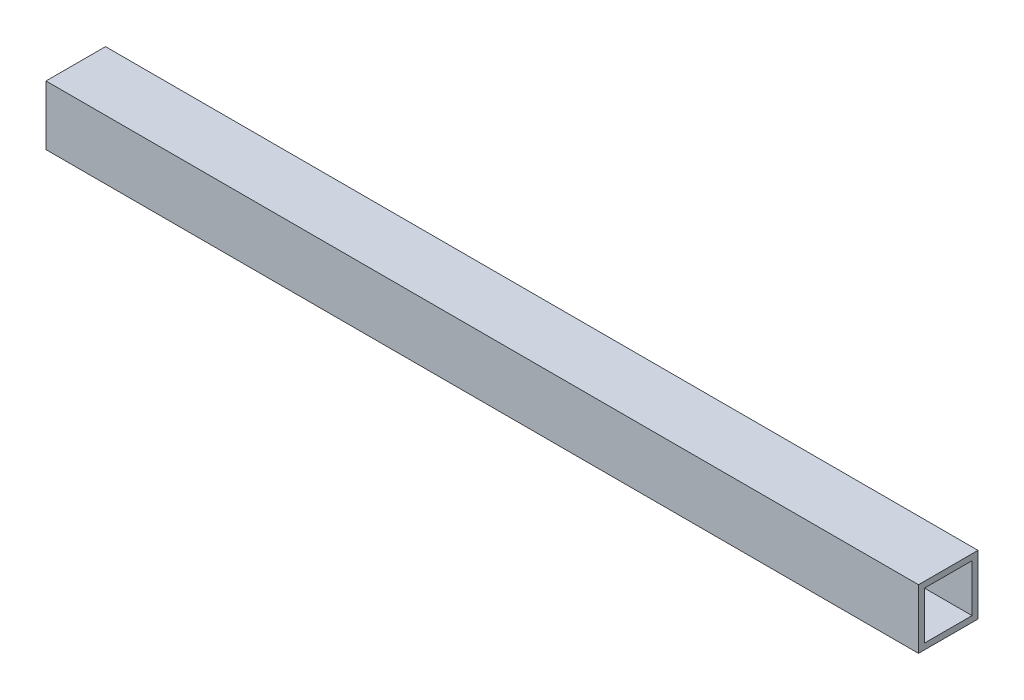
ISO-10303-21;
HEADER;
FILE_DESCRIPTION(('STEP AP214'),'2;1');
FILE_NAME('part.step','',(''),(''),'','','');
FILE_SCHEMA(('AUTOMOTIVE_DESIGN { 1 0 10303 214 1 1 1 1 }'));
ENDSEC;
DATA;
#1=APPLICATION_CONTEXT('core data for automotive mechanical design processes');
#2=APPLICATION_PROTOCOL_DEFINITION('international standard','automotive_design',2000,#1);
#3=PRODUCT_CONTEXT('',#1,'mechanical');
#4=PRODUCT('Part','Part','',(#3));
#5=PRODUCT_RELATED_PRODUCT_CATEGORY('part','',(#4));
#6=PRODUCT_DEFINITION_FORMATION('','',#4);
#7=PRODUCT_DEFINITION_CONTEXT('part definition',#1,'design');
#8=PRODUCT_DEFINITION('design','',#6,#7);
#9=PRODUCT_DEFINITION_SHAPE('','',#8);
#10=(LENGTH_UNIT() NAMED_UNIT(*) SI_UNIT(.MILLI.,.METRE.));
#11=(NAMED_UNIT(*) PLANE_ANGLE_UNIT() SI_UNIT($,.RADIAN.));
#12=(NAMED_UNIT(*) SI_UNIT($,.STERADIAN.) SOLID_ANGLE_UNIT());
#13=UNCERTAINTY_MEASURE_WITH_UNIT(LENGTH_MEASURE(1.E-05),#10,'distance_accuracy_value','');
#14=(GEOMETRIC_REPRESENTATION_CONTEXT(3) GLOBAL_UNCERTAINTY_ASSIGNED_CONTEXT((#13)) GLOBAL_UNIT_ASSIGNED_CONTEXT((#10,
#11,#12)) REPRESENTATION_CONTEXT('',''));
#15=CARTESIAN_POINT('',(0.,0.,0.));
#16=DIRECTION('',(0.,0.,1.));
#17=DIRECTION('',(1.,0.,0.));
#18=AXIS2_PLACEMENT_3D('',#15,#16,#17);
#19=CARTESIAN_POINT('',(110.,0.,0.));
#20=DIRECTION('',(1.,0.,0.));
#21=DIRECTION('',(0.,0.,-1.));
#22=AXIS2_PLACEMENT_3D('',#19,#20,#21);
#23=PLANE('',#22);
#24=DIRECTION('',(0.,1.,0.));
#25=VECTOR('',#24,1.);
#26=CARTESIAN_POINT('',(110.,7.5,-7.5));
#27=LINE('',#26,#25);
#28=CARTESIAN_POINT('',(110.,-7.5,-7.5));
#29=VERTEX_POINT('',#28);
#30=CARTESIAN_POINT('',(110.,7.5,-7.5));
#31=VERTEX_POINT('',#30);
#32=EDGE_CURVE('E134',#29,#31,#27,.T.);
#33=ORIENTED_EDGE('',*,*,#32,.T.);
#34=DIRECTION('',(0.,0.,1.));
#35=VECTOR('',#34,1.);
#36=CARTESIAN_POINT('',(110.,7.5,7.5));
#37=LINE('',#36,#35);
#38=CARTESIAN_POINT('',(110.,7.5,7.5));
#39=VERTEX_POINT('',#38);
#40=EDGE_CURVE('E137',#31,#39,#37,.T.);
#41=ORIENTED_EDGE('',*,*,#40,.T.);
#42=DIRECTION('',(0.,-1.,0.));
#43=VECTOR('',#42,1.);
#44=CARTESIAN_POINT('',(110.,7.5,7.5));
#45=LINE('',#44,#43);
#46=CARTESIAN_POINT('',(110.,-7.5,7.5));
#47=VERTEX_POINT('',#46);
#48=EDGE_CURVE('E140',#39,#47,#45,.T.);
#49=ORIENTED_EDGE('',*,*,#48,.T.);
#50=DIRECTION('',(0.,0.,-1.));
#51=VECTOR('',#50,1.);
#52=CARTESIAN_POINT('',(110.,-7.5,7.5));
#53=LINE('',#52,#51);
#54=EDGE_CURVE('E142',#47,#29,#53,.T.);
#55=ORIENTED_EDGE('',*,*,#54,.T.);
#56=EDGE_LOOP('',(#33,#41,#49,#55));
#57=FACE_BOUND('',#56,.T.);
#58=DIRECTION('',(0.,0.,-1.));
#59=VECTOR('',#58,1.);
#60=CARTESIAN_POINT('',(110.,-6.,6.));
#61=LINE('',#60,#59);
#62=CARTESIAN_POINT('',(110.,-6.,6.));
#63=VERTEX_POINT('',#62);
#64=CARTESIAN_POINT('',(110.,-6.,-6.));
#65=VERTEX_POINT('',#64);
#66=EDGE_CURVE('E106',#63,#65,#61,.T.);
#67=ORIENTED_EDGE('',*,*,#66,.F.);
#68=DIRECTION('',(0.,-1.,0.));
#69=VECTOR('',#68,1.);
#70=CARTESIAN_POINT('',(110.,6.,6.));
#71=LINE('',#70,#69);
#72=CARTESIAN_POINT('',(110.,6.,6.));
#73=VERTEX_POINT('',#72);
#74=EDGE_CURVE('E98',#73,#63,#71,.T.);
#75=ORIENTED_EDGE('',*,*,#74,.F.);
#76=DIRECTION('',(0.,0.,1.));
#77=VECTOR('',#76,1.);
#78=CARTESIAN_POINT('',(110.,6.,6.));
#79=LINE('',#78,#77);
#80=CARTESIAN_POINT('',(110.,6.,-6.));
#81=VERTEX_POINT('',#80);
#82=EDGE_CURVE('E120',#81,#73,#79,.T.);
#83=ORIENTED_EDGE('',*,*,#82,.F.);
#84=DIRECTION('',(0.,1.,0.));
#85=VECTOR('',#84,1.);
#86=CARTESIAN_POINT('',(110.,6.,-6.));
#87=LINE('',#86,#85);
#88=EDGE_CURVE('E118',#65,#81,#87,.T.);
#89=ORIENTED_EDGE('',*,*,#88,.F.);
#90=EDGE_LOOP('',(#67,#75,#83,#89));
#91=FACE_BOUND('',#90,.T.);
#92=ADVANCED_FACE('F33',(#57,#91),#23,.T.);
#93=CARTESIAN_POINT('',(-110.,0.,0.));
#94=DIRECTION('',(1.,0.,0.));
#95=DIRECTION('',(0.,0.,-1.));
#96=AXIS2_PLACEMENT_3D('',#93,#94,#95);
#97=PLANE('',#96);
#98=DIRECTION('',(0.,1.,0.));
#99=VECTOR('',#98,1.);
#100=CARTESIAN_POINT('',(-110.,7.5,-7.5));
#101=LINE('',#100,#99);
#102=CARTESIAN_POINT('',(-110.,-7.5,-7.5));
#103=VERTEX_POINT('',#102);
#104=CARTESIAN_POINT('',(-110.,7.5,-7.5));
#105=VERTEX_POINT('',#104);
#106=EDGE_CURVE('E114',#103,#105,#101,.T.);
#107=ORIENTED_EDGE('',*,*,#106,.F.);
#108=DIRECTION('',(0.,0.,-1.));
#109=VECTOR('',#108,1.);
#110=CARTESIAN_POINT('',(-110.,-7.5,7.5));
#111=LINE('',#110,#109);
#112=CARTESIAN_POINT('',(-110.,-7.5,7.5));
#113=VERTEX_POINT('',#112);
#114=EDGE_CURVE('E138',#113,#103,#111,.T.);
#115=ORIENTED_EDGE('',*,*,#114,.F.);
#116=DIRECTION('',(0.,-1.,0.));
#117=VECTOR('',#116,1.);
#118=CARTESIAN_POINT('',(-110.,7.5,7.5));
#119=LINE('',#118,#117);
#120=CARTESIAN_POINT('',(-110.,7.5,7.5));
#121=VERTEX_POINT('',#120);
#122=EDGE_CURVE('E149',#121,#113,#119,.T.);
#123=ORIENTED_EDGE('',*,*,#122,.F.);
#124=DIRECTION('',(0.,0.,1.));
#125=VECTOR('',#124,1.);
#126=CARTESIAN_POINT('',(-110.,7.5,7.5));
#127=LINE('',#126,#125);
#128=EDGE_CURVE('E147',#105,#121,#127,.T.);
#129=ORIENTED_EDGE('',*,*,#128,.F.);
#130=EDGE_LOOP('',(#107,#115,#123,#129));
#131=FACE_BOUND('',#130,.T.);
#132=DIRECTION('',(0.,-1.,0.));
#133=VECTOR('',#132,1.);
#134=CARTESIAN_POINT('',(-110.,6.,6.));
#135=LINE('',#134,#133);
#136=CARTESIAN_POINT('',(-110.,6.,6.));
#137=VERTEX_POINT('',#136);
#138=CARTESIAN_POINT('',(-110.,-6.,6.));
#139=VERTEX_POINT('',#138);
#140=EDGE_CURVE('E56',#137,#139,#135,.T.);
#141=ORIENTED_EDGE('',*,*,#140,.T.);
#142=DIRECTION('',(0.,0.,-1.));
#143=VECTOR('',#142,1.);
#144=CARTESIAN_POINT('',(-110.,-6.,6.));
#145=LINE('',#144,#143);
#146=CARTESIAN_POINT('',(-110.,-6.,-6.));
#147=VERTEX_POINT('',#146);
#148=EDGE_CURVE('E113',#139,#147,#145,.T.);
#149=ORIENTED_EDGE('',*,*,#148,.T.);
#150=DIRECTION('',(0.,1.,0.));
#151=VECTOR('',#150,1.);
#152=CARTESIAN_POINT('',(-110.,6.,-6.));
#153=LINE('',#152,#151);
#154=CARTESIAN_POINT('',(-110.,6.,-6.));
#155=VERTEX_POINT('',#154);
#156=EDGE_CURVE('E126',#147,#155,#153,.T.);
#157=ORIENTED_EDGE('',*,*,#156,.T.);
#158=DIRECTION('',(0.,0.,1.));
#159=VECTOR('',#158,1.);
#160=CARTESIAN_POINT('',(-110.,6.,6.));
#161=LINE('',#160,#159);
#162=EDGE_CURVE('E107',#155,#137,#161,.T.);
#163=ORIENTED_EDGE('',*,*,#162,.T.);
#164=EDGE_LOOP('',(#141,#149,#157,#163));
#165=FACE_BOUND('',#164,.T.);
#166=ADVANCED_FACE('F167',(#131,#165),#97,.F.);
#167=CARTESIAN_POINT('',(110.,7.5,-7.5));
#168=DIRECTION('',(0.,0.,1.));
#169=DIRECTION('',(0.,-1.,0.));
#170=AXIS2_PLACEMENT_3D('',#167,#168,#169);
#171=PLANE('',#170);
#172=ORIENTED_EDGE('',*,*,#106,.T.);
#173=DIRECTION('',(-1.,0.,0.));
#174=VECTOR('',#173,1.);
#175=CARTESIAN_POINT('',(110.,7.5,-7.5));
#176=LINE('',#175,#174);
#177=EDGE_CURVE('E11',#31,#105,#176,.T.);
#178=ORIENTED_EDGE('',*,*,#177,.F.);
#179=ORIENTED_EDGE('',*,*,#32,.F.);
#180=DIRECTION('',(-1.,0.,0.));
#181=VECTOR('',#180,1.);
#182=CARTESIAN_POINT('',(110.,-7.5,-7.5));
#183=LINE('',#182,#181);
#184=EDGE_CURVE('E144',#29,#103,#183,.T.);
#185=ORIENTED_EDGE('',*,*,#184,.T.);
#186=EDGE_LOOP('',(#172,#178,#179,#185));
#187=FACE_BOUND('',#186,.T.);
#188=ADVANCED_FACE('F35',(#187),#171,.F.);
#189=CARTESIAN_POINT('',(110.,7.5,7.5));
#190=DIRECTION('',(0.,-1.,0.));
#191=DIRECTION('',(0.,0.,-1.));
#192=AXIS2_PLACEMENT_3D('',#189,#190,#191);
#193=PLANE('',#192);
#194=ORIENTED_EDGE('',*,*,#128,.T.);
#195=DIRECTION('',(-1.,0.,0.));
#196=VECTOR('',#195,1.);
#197=CARTESIAN_POINT('',(110.,7.5,7.5));
#198=LINE('',#197,#196);
#199=EDGE_CURVE('E41',#39,#121,#198,.T.);
#200=ORIENTED_EDGE('',*,*,#199,.F.);
#201=ORIENTED_EDGE('',*,*,#40,.F.);
#202=ORIENTED_EDGE('',*,*,#177,.T.);
#203=EDGE_LOOP('',(#194,#200,#201,#202));
#204=FACE_BOUND('',#203,.T.);
#205=ADVANCED_FACE('F177',(#204),#193,.F.);
#206=CARTESIAN_POINT('',(110.,7.5,7.5));
#207=DIRECTION('',(0.,0.,-1.));
#208=DIRECTION('',(0.,1.,0.));
#209=AXIS2_PLACEMENT_3D('',#206,#207,#208);
#210=PLANE('',#209);
#211=ORIENTED_EDGE('',*,*,#122,.T.);
#212=DIRECTION('',(-1.,0.,0.));
#213=VECTOR('',#212,1.);
#214=CARTESIAN_POINT('',(110.,-7.5,7.5));
#215=LINE('',#214,#213);
#216=EDGE_CURVE('E154',#47,#113,#215,.T.);
#217=ORIENTED_EDGE('',*,*,#216,.F.);
#218=ORIENTED_EDGE('',*,*,#48,.F.);
#219=ORIENTED_EDGE('',*,*,#199,.T.);
#220=EDGE_LOOP('',(#211,#217,#218,#219));
#221=FACE_BOUND('',#220,.T.);
#222=ADVANCED_FACE('F161',(#221),#210,.F.);
#223=CARTESIAN_POINT('',(110.,-7.5,7.5));
#224=DIRECTION('',(0.,1.,0.));
#225=DIRECTION('',(0.,0.,1.));
#226=AXIS2_PLACEMENT_3D('',#223,#224,#225);
#227=PLANE('',#226);
#228=ORIENTED_EDGE('',*,*,#114,.T.);
#229=ORIENTED_EDGE('',*,*,#184,.F.);
#230=ORIENTED_EDGE('',*,*,#54,.F.);
#231=ORIENTED_EDGE('',*,*,#216,.T.);
#232=EDGE_LOOP('',(#228,#229,#230,#231));
#233=FACE_BOUND('',#232,.T.);
#234=ADVANCED_FACE('F171',(#233),#227,.F.);
#235=CARTESIAN_POINT('',(110.,6.,6.));
#236=DIRECTION('',(0.,0.,-1.));
#237=DIRECTION('',(0.,1.,0.));
#238=AXIS2_PLACEMENT_3D('',#235,#236,#237);
#239=PLANE('',#238);
#240=ORIENTED_EDGE('',*,*,#140,.F.);
#241=DIRECTION('',(-1.,0.,0.));
#242=VECTOR('',#241,1.);
#243=CARTESIAN_POINT('',(110.,6.,6.));
#244=LINE('',#243,#242);
#245=EDGE_CURVE('E102',#73,#137,#244,.T.);
#246=ORIENTED_EDGE('',*,*,#245,.F.);
#247=ORIENTED_EDGE('',*,*,#74,.T.);
#248=DIRECTION('',(-1.,0.,0.));
#249=VECTOR('',#248,1.);
#250=CARTESIAN_POINT('',(110.,-6.,6.));
#251=LINE('',#250,#249);
#252=EDGE_CURVE('E101',#63,#139,#251,.T.);
#253=ORIENTED_EDGE('',*,*,#252,.T.);
#254=EDGE_LOOP('',(#240,#246,#247,#253));
#255=FACE_BOUND('',#254,.T.);
#256=ADVANCED_FACE('F100',(#255),#239,.T.);
#257=CARTESIAN_POINT('',(110.,-6.,6.));
#258=DIRECTION('',(0.,1.,0.));
#259=DIRECTION('',(0.,0.,1.));
#260=AXIS2_PLACEMENT_3D('',#257,#258,#259);
#261=PLANE('',#260);
#262=ORIENTED_EDGE('',*,*,#148,.F.);
#263=ORIENTED_EDGE('',*,*,#252,.F.);
#264=ORIENTED_EDGE('',*,*,#66,.T.);
#265=DIRECTION('',(-1.,0.,0.));
#266=VECTOR('',#265,1.);
#267=CARTESIAN_POINT('',(110.,-6.,-6.));
#268=LINE('',#267,#266);
#269=EDGE_CURVE('E115',#65,#147,#268,.T.);
#270=ORIENTED_EDGE('',*,*,#269,.T.);
#271=EDGE_LOOP('',(#262,#263,#264,#270));
#272=FACE_BOUND('',#271,.T.);
#273=ADVANCED_FACE('F110',(#272),#261,.T.);
#274=CARTESIAN_POINT('',(110.,6.,-6.));
#275=DIRECTION('',(0.,0.,1.));
#276=DIRECTION('',(0.,-1.,0.));
#277=AXIS2_PLACEMENT_3D('',#274,#275,#276);
#278=PLANE('',#277);
#279=ORIENTED_EDGE('',*,*,#156,.F.);
#280=ORIENTED_EDGE('',*,*,#269,.F.);
#281=ORIENTED_EDGE('',*,*,#88,.T.);
#282=DIRECTION('',(-1.,0.,0.));
#283=VECTOR('',#282,1.);
#284=CARTESIAN_POINT('',(110.,6.,-6.));
#285=LINE('',#284,#283);
#286=EDGE_CURVE('E48',#81,#155,#285,.T.);
#287=ORIENTED_EDGE('',*,*,#286,.T.);
#288=EDGE_LOOP('',(#279,#280,#281,#287));
#289=FACE_BOUND('',#288,.T.);
#290=ADVANCED_FACE('F200',(#289),#278,.T.);
#291=CARTESIAN_POINT('',(110.,6.,6.));
#292=DIRECTION('',(0.,-1.,0.));
#293=DIRECTION('',(0.,0.,-1.));
#294=AXIS2_PLACEMENT_3D('',#291,#292,#293);
#295=PLANE('',#294);
#296=ORIENTED_EDGE('',*,*,#162,.F.);
#297=ORIENTED_EDGE('',*,*,#286,.F.);
#298=ORIENTED_EDGE('',*,*,#82,.T.);
#299=ORIENTED_EDGE('',*,*,#245,.T.);
#300=EDGE_LOOP('',(#296,#297,#298,#299));
#301=FACE_BOUND('',#300,.T.);
#302=ADVANCED_FACE('F204',(#301),#295,.T.);
#303=CLOSED_SHELL('',(#92,#166,#188,#205,#222,#234,#256,#273,#290,#302));
#304=MANIFOLD_SOLID_BREP('B2',#303);
#305=ADVANCED_BREP_SHAPE_REPRESENTATION('',(#18,#304),#14);
#306=SHAPE_DEFINITION_REPRESENTATION(#9,#305);
ENDSEC;
END-ISO-10303-21;
